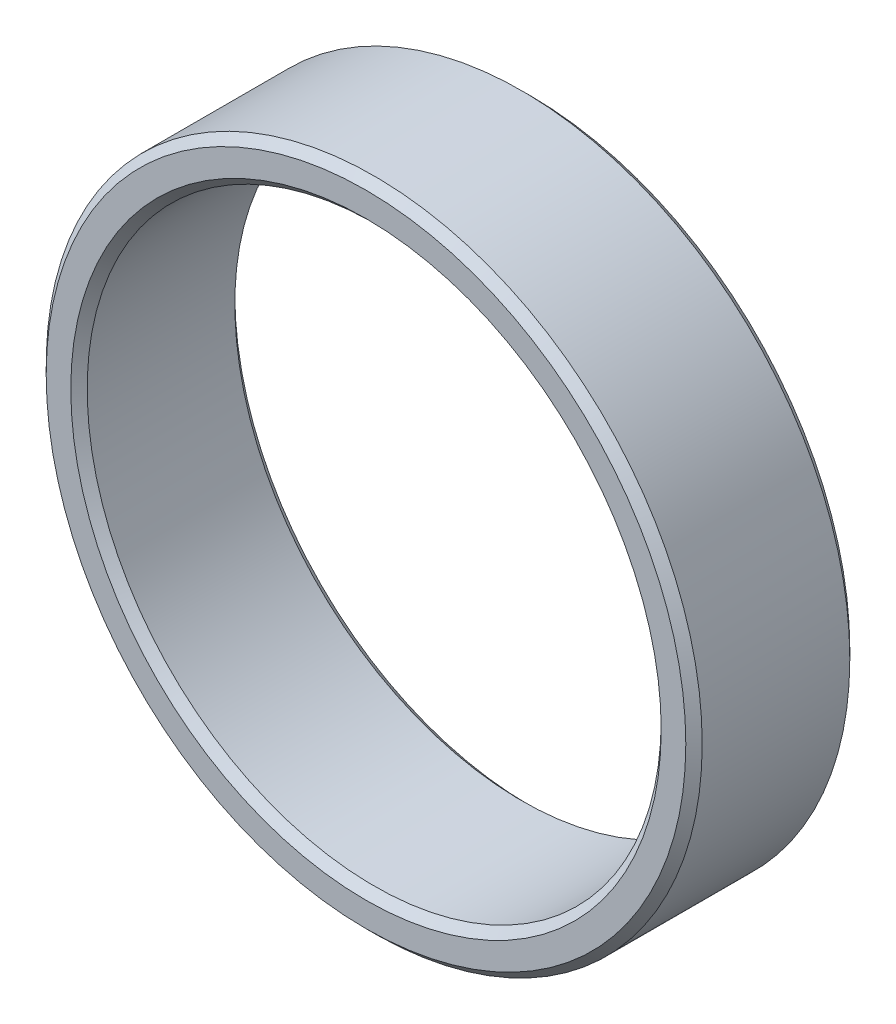
ISO-10303-21;
HEADER;
FILE_DESCRIPTION(('STEP AP214'),'2;1');
FILE_NAME('part.step','',(''),(''),'','','');
FILE_SCHEMA(('AUTOMOTIVE_DESIGN { 1 0 10303 214 1 1 1 1 }'));
ENDSEC;
DATA;
#1=APPLICATION_CONTEXT('core data for automotive mechanical design processes');
#2=APPLICATION_PROTOCOL_DEFINITION('international standard','automotive_design',2000,#1);
#3=PRODUCT_CONTEXT('',#1,'mechanical');
#4=PRODUCT('Part','Part','',(#3));
#5=PRODUCT_RELATED_PRODUCT_CATEGORY('part','',(#4));
#6=PRODUCT_DEFINITION_FORMATION('','',#4);
#7=PRODUCT_DEFINITION_CONTEXT('part definition',#1,'design');
#8=PRODUCT_DEFINITION('design','',#6,#7);
#9=PRODUCT_DEFINITION_SHAPE('','',#8);
#10=(LENGTH_UNIT() NAMED_UNIT(*) SI_UNIT(.MILLI.,.METRE.));
#11=(NAMED_UNIT(*) PLANE_ANGLE_UNIT() SI_UNIT($,.RADIAN.));
#12=(NAMED_UNIT(*) SI_UNIT($,.STERADIAN.) SOLID_ANGLE_UNIT());
#13=UNCERTAINTY_MEASURE_WITH_UNIT(LENGTH_MEASURE(1.E-05),#10,'distance_accuracy_value','');
#14=(GEOMETRIC_REPRESENTATION_CONTEXT(3) GLOBAL_UNCERTAINTY_ASSIGNED_CONTEXT((#13)) GLOBAL_UNIT_ASSIGNED_CONTEXT((#10,
#11,#12)) REPRESENTATION_CONTEXT('',''));
#15=CARTESIAN_POINT('',(0.,0.,0.));
#16=DIRECTION('',(0.,0.,1.));
#17=DIRECTION('',(1.,0.,0.));
#18=AXIS2_PLACEMENT_3D('',#15,#16,#17);
#19=CARTESIAN_POINT('',(0.,0.,4.));
#20=DIRECTION('',(0.,0.,1.));
#21=DIRECTION('',(1.,0.,0.));
#22=AXIS2_PLACEMENT_3D('',#19,#20,#21);
#23=PLANE('',#22);
#24=CARTESIAN_POINT('',(0.,0.,4.));
#25=DIRECTION('',(0.,0.,1.));
#26=DIRECTION('',(1.,0.,0.));
#27=AXIS2_PLACEMENT_3D('',#24,#25,#26);
#28=CIRCLE('',#27,7.8);
#29=CARTESIAN_POINT('',(7.8,0.,4.));
#30=VERTEX_POINT('',#29);
#31=EDGE_CURVE('E42',#30,#30,#28,.T.);
#32=ORIENTED_EDGE('',*,*,#31,.T.);
#33=EDGE_LOOP('',(#32));
#34=FACE_BOUND('',#33,.T.);
#35=CARTESIAN_POINT('',(0.,0.,4.));
#36=DIRECTION('',(0.,0.,1.));
#37=DIRECTION('',(1.,0.,0.));
#38=AXIS2_PLACEMENT_3D('',#35,#36,#37);
#39=CIRCLE('',#38,7.2);
#40=CARTESIAN_POINT('',(7.2,0.,4.));
#41=VERTEX_POINT('',#40);
#42=EDGE_CURVE('E46',#41,#41,#39,.F.);
#43=ORIENTED_EDGE('',*,*,#42,.T.);
#44=EDGE_LOOP('',(#43));
#45=FACE_BOUND('',#44,.T.);
#46=ADVANCED_FACE('F31',(#34,#45),#23,.T.);
#47=CARTESIAN_POINT('',(0.,0.,0.));
#48=DIRECTION('',(0.,0.,1.));
#49=DIRECTION('',(1.,0.,0.));
#50=AXIS2_PLACEMENT_3D('',#47,#48,#49);
#51=PLANE('',#50);
#52=CARTESIAN_POINT('',(0.,0.,0.));
#53=DIRECTION('',(0.,0.,1.));
#54=DIRECTION('',(1.,0.,0.));
#55=AXIS2_PLACEMENT_3D('',#52,#53,#54);
#56=CIRCLE('',#55,7.8);
#57=CARTESIAN_POINT('',(7.8,0.,0.));
#58=VERTEX_POINT('',#57);
#59=EDGE_CURVE('E51',#58,#58,#56,.F.);
#60=ORIENTED_EDGE('',*,*,#59,.T.);
#61=EDGE_LOOP('',(#60));
#62=FACE_BOUND('',#61,.T.);
#63=CARTESIAN_POINT('',(0.,0.,0.));
#64=DIRECTION('',(0.,0.,1.));
#65=DIRECTION('',(1.,0.,0.));
#66=AXIS2_PLACEMENT_3D('',#63,#64,#65);
#67=CIRCLE('',#66,7.2);
#68=CARTESIAN_POINT('',(7.2,0.,0.));
#69=VERTEX_POINT('',#68);
#70=EDGE_CURVE('E54',#69,#69,#67,.T.);
#71=ORIENTED_EDGE('',*,*,#70,.T.);
#72=EDGE_LOOP('',(#71));
#73=FACE_BOUND('',#72,.T.);
#74=ADVANCED_FACE('F75',(#62,#73),#51,.F.);
#75=CARTESIAN_POINT('',(0.,0.,4.));
#76=DIRECTION('',(0.,0.,-1.));
#77=DIRECTION('',(-1.,0.,0.));
#78=AXIS2_PLACEMENT_3D('',#75,#76,#77);
#79=CYLINDRICAL_SURFACE('',#78,8.);
#80=CARTESIAN_POINT('',(0.,0.,0.200000000000001));
#81=DIRECTION('',(0.,0.,1.));
#82=DIRECTION('',(1.,0.,0.));
#83=AXIS2_PLACEMENT_3D('',#80,#81,#82);
#84=CIRCLE('',#83,8.);
#85=CARTESIAN_POINT('',(8.,0.,0.200000000000001));
#86=VERTEX_POINT('',#85);
#87=EDGE_CURVE('E57',#86,#86,#84,.T.);
#88=ORIENTED_EDGE('',*,*,#87,.T.);
#89=EDGE_LOOP('',(#88));
#90=FACE_BOUND('',#89,.T.);
#91=CARTESIAN_POINT('',(0.,0.,3.8));
#92=DIRECTION('',(0.,0.,1.));
#93=DIRECTION('',(1.,0.,0.));
#94=AXIS2_PLACEMENT_3D('',#91,#92,#93);
#95=CIRCLE('',#94,8.);
#96=CARTESIAN_POINT('',(8.,0.,3.8));
#97=VERTEX_POINT('',#96);
#98=EDGE_CURVE('E60',#97,#97,#95,.F.);
#99=ORIENTED_EDGE('',*,*,#98,.T.);
#100=EDGE_LOOP('',(#99));
#101=FACE_BOUND('',#100,.T.);
#102=ADVANCED_FACE('F33',(#90,#101),#79,.T.);
#103=CARTESIAN_POINT('',(0.,0.,4.));
#104=DIRECTION('',(0.,0.,-1.));
#105=DIRECTION('',(-1.,0.,0.));
#106=AXIS2_PLACEMENT_3D('',#103,#104,#105);
#107=CYLINDRICAL_SURFACE('',#106,7.);
#108=CARTESIAN_POINT('',(0.,0.,3.8));
#109=DIRECTION('',(0.,0.,1.));
#110=DIRECTION('',(1.,0.,0.));
#111=AXIS2_PLACEMENT_3D('',#108,#109,#110);
#112=CIRCLE('',#111,7.);
#113=CARTESIAN_POINT('',(7.,0.,3.8));
#114=VERTEX_POINT('',#113);
#115=EDGE_CURVE('E10',#114,#114,#112,.T.);
#116=ORIENTED_EDGE('',*,*,#115,.T.);
#117=EDGE_LOOP('',(#116));
#118=FACE_BOUND('',#117,.T.);
#119=CARTESIAN_POINT('',(0.,0.,0.200000000000001));
#120=DIRECTION('',(0.,0.,1.));
#121=DIRECTION('',(1.,0.,0.));
#122=AXIS2_PLACEMENT_3D('',#119,#120,#121);
#123=CIRCLE('',#122,7.);
#124=CARTESIAN_POINT('',(7.,0.,0.200000000000001));
#125=VERTEX_POINT('',#124);
#126=EDGE_CURVE('E38',#125,#125,#123,.F.);
#127=ORIENTED_EDGE('',*,*,#126,.T.);
#128=EDGE_LOOP('',(#127));
#129=FACE_BOUND('',#128,.T.);
#130=ADVANCED_FACE('F90',(#118,#129),#107,.F.);
#131=CARTESIAN_POINT('',(0.,0.,0.200000000000001));
#132=DIRECTION('',(0.,0.,1.));
#133=DIRECTION('',(1.,0.,0.));
#134=AXIS2_PLACEMENT_3D('',#131,#132,#133);
#135=CONICAL_SURFACE('',#134,8.,0.785398163397453);
#136=ORIENTED_EDGE('',*,*,#59,.F.);
#137=EDGE_LOOP('',(#136));
#138=FACE_BOUND('',#137,.T.);
#139=ORIENTED_EDGE('',*,*,#87,.F.);
#140=EDGE_LOOP('',(#139));
#141=FACE_BOUND('',#140,.T.);
#142=ADVANCED_FACE('F69',(#138,#141),#135,.T.);
#143=CARTESIAN_POINT('',(0.,0.,4.));
#144=DIRECTION('',(0.,0.,-1.));
#145=DIRECTION('',(-1.,0.,0.));
#146=AXIS2_PLACEMENT_3D('',#143,#144,#145);
#147=CONICAL_SURFACE('',#146,7.8,0.785398163397453);
#148=ORIENTED_EDGE('',*,*,#98,.F.);
#149=EDGE_LOOP('',(#148));
#150=FACE_BOUND('',#149,.T.);
#151=ORIENTED_EDGE('',*,*,#31,.F.);
#152=EDGE_LOOP('',(#151));
#153=FACE_BOUND('',#152,.T.);
#154=ADVANCED_FACE('F65',(#150,#153),#147,.T.);
#155=CARTESIAN_POINT('',(0.,0.,3.8));
#156=DIRECTION('',(0.,0.,1.));
#157=DIRECTION('',(1.,0.,0.));
#158=AXIS2_PLACEMENT_3D('',#155,#156,#157);
#159=CONICAL_SURFACE('',#158,7.,0.785398163397453);
#160=ORIENTED_EDGE('',*,*,#42,.F.);
#161=EDGE_LOOP('',(#160));
#162=FACE_BOUND('',#161,.T.);
#163=ORIENTED_EDGE('',*,*,#115,.F.);
#164=EDGE_LOOP('',(#163));
#165=FACE_BOUND('',#164,.T.);
#166=ADVANCED_FACE('F68',(#162,#165),#159,.F.);
#167=CARTESIAN_POINT('',(0.,0.,0.));
#168=DIRECTION('',(0.,0.,-1.));
#169=DIRECTION('',(-1.,0.,0.));
#170=AXIS2_PLACEMENT_3D('',#167,#168,#169);
#171=CONICAL_SURFACE('',#170,7.2,0.785398163397453);
#172=ORIENTED_EDGE('',*,*,#126,.F.);
#173=EDGE_LOOP('',(#172));
#174=FACE_BOUND('',#173,.T.);
#175=ORIENTED_EDGE('',*,*,#70,.F.);
#176=EDGE_LOOP('',(#175));
#177=FACE_BOUND('',#176,.T.);
#178=ADVANCED_FACE('F80',(#174,#177),#171,.F.);
#179=CLOSED_SHELL('',(#46,#74,#102,#130,#142,#154,#166,#178));
#180=MANIFOLD_SOLID_BREP('B2',#179);
#181=ADVANCED_BREP_SHAPE_REPRESENTATION('',(#18,#180),#14);
#182=SHAPE_DEFINITION_REPRESENTATION(#9,#181);
ENDSEC;
END-ISO-10303-21;
